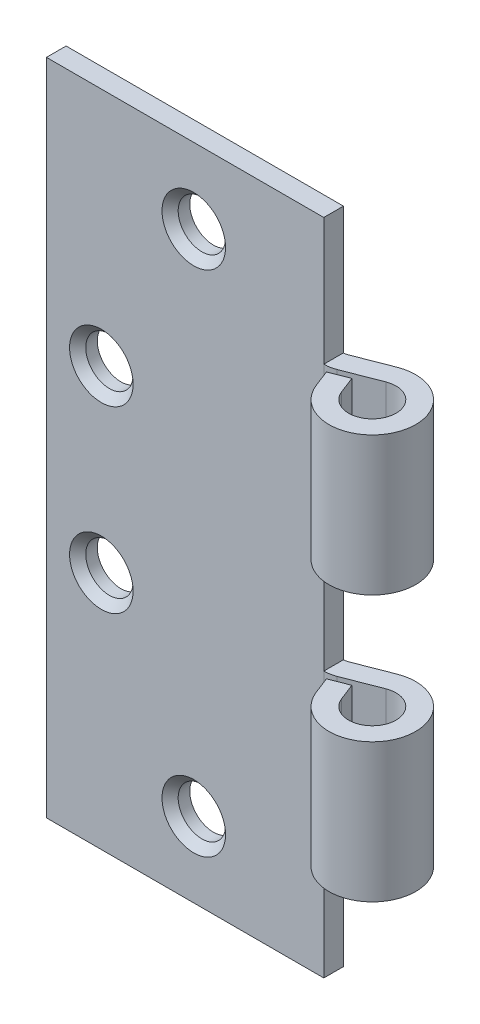
ISO-10303-21;
HEADER;
FILE_DESCRIPTION(('STEP AP214'),'2;1');
FILE_NAME('part.step','',(''),(''),'','','');
FILE_SCHEMA(('AUTOMOTIVE_DESIGN { 1 0 10303 214 1 1 1 1 }'));
ENDSEC;
DATA;
#1=APPLICATION_CONTEXT('core data for automotive mechanical design processes');
#2=APPLICATION_PROTOCOL_DEFINITION('international standard','automotive_design',2000,#1);
#3=PRODUCT_CONTEXT('',#1,'mechanical');
#4=PRODUCT('Part','Part','',(#3));
#5=PRODUCT_RELATED_PRODUCT_CATEGORY('part','',(#4));
#6=PRODUCT_DEFINITION_FORMATION('','',#4);
#7=PRODUCT_DEFINITION_CONTEXT('part definition',#1,'design');
#8=PRODUCT_DEFINITION('design','',#6,#7);
#9=PRODUCT_DEFINITION_SHAPE('','',#8);
#10=(LENGTH_UNIT() NAMED_UNIT(*) SI_UNIT(.MILLI.,.METRE.));
#11=(NAMED_UNIT(*) PLANE_ANGLE_UNIT() SI_UNIT($,.RADIAN.));
#12=(NAMED_UNIT(*) SI_UNIT($,.STERADIAN.) SOLID_ANGLE_UNIT());
#13=UNCERTAINTY_MEASURE_WITH_UNIT(LENGTH_MEASURE(1.E-05),#10,'distance_accuracy_value','');
#14=(GEOMETRIC_REPRESENTATION_CONTEXT(3) GLOBAL_UNCERTAINTY_ASSIGNED_CONTEXT((#13)) GLOBAL_UNIT_ASSIGNED_CONTEXT((#10,
#11,#12)) REPRESENTATION_CONTEXT('',''));
#15=CARTESIAN_POINT('',(0.,0.,0.));
#16=DIRECTION('',(0.,0.,1.));
#17=DIRECTION('',(1.,0.,0.));
#18=AXIS2_PLACEMENT_3D('',#15,#16,#17);
#19=CARTESIAN_POINT('',(41.,-35.,-4.7));
#20=DIRECTION('',(0.,1.,0.));
#21=DIRECTION('',(-1.,0.,0.));
#22=AXIS2_PLACEMENT_3D('',#19,#20,#21);
#23=PLANE('',#22);
#24=CARTESIAN_POINT('',(33.5,-35.,2.8));
#25=DIRECTION('',(0.,-1.,0.));
#26=DIRECTION('',(0.,0.,-1.));
#27=AXIS2_PLACEMENT_3D('',#24,#25,#26);
#28=CIRCLE('',#27,5.49999999999998);
#29=CARTESIAN_POINT('',(28.5976718591575,-35.,0.306572880651311));
#30=VERTEX_POINT('',#29);
#31=CARTESIAN_POINT('',(28.1424441919618,-35.,1.55637796587718));
#32=VERTEX_POINT('',#31);
#33=EDGE_CURVE('E203',#30,#32,#28,.T.);
#34=ORIENTED_EDGE('',*,*,#33,.F.);
#35=DIRECTION('',(0.932075471698113,0.,-0.362264150943397));
#36=VECTOR('',#35,1.);
#37=CARTESIAN_POINT('',(32.0147169811321,-35.,-1.02150943396228));
#38=LINE('',#37,#36);
#39=CARTESIAN_POINT('',(25.9562264150943,-35.,1.33320754716981));
#40=VERTEX_POINT('',#39);
#41=EDGE_CURVE('E226',#40,#30,#38,.T.);
#42=ORIENTED_EDGE('',*,*,#41,.F.);
#43=CARTESIAN_POINT('',(24.,-35.,-3.7));
#44=DIRECTION('',(0.,1.,0.));
#45=DIRECTION('',(-1.,0.,0.));
#46=AXIS2_PLACEMENT_3D('',#43,#44,#45);
#47=CIRCLE('',#46,5.39999999999999);
#48=CARTESIAN_POINT('',(24.,-35.,1.69999999999999));
#49=VERTEX_POINT('',#48);
#50=EDGE_CURVE('E387',#49,#40,#47,.T.);
#51=ORIENTED_EDGE('',*,*,#50,.F.);
#52=DIRECTION('',(0.,0.,1.));
#53=VECTOR('',#52,1.);
#54=CARTESIAN_POINT('',(24.,-35.,-4.7));
#55=LINE('',#54,#53);
#56=CARTESIAN_POINT('',(24.,-35.,-1.7));
#57=VERTEX_POINT('',#56);
#58=EDGE_CURVE('E221',#57,#49,#55,.T.);
#59=ORIENTED_EDGE('',*,*,#58,.F.);
#60=CARTESIAN_POINT('',(24.,-35.,-3.7));
#61=DIRECTION('',(0.,1.,0.));
#62=DIRECTION('',(-1.,0.,0.));
#63=AXIS2_PLACEMENT_3D('',#60,#61,#62);
#64=CIRCLE('',#63,2.);
#65=CARTESIAN_POINT('',(24.7245283018868,-35.,-1.83584905660377));
#66=VERTEX_POINT('',#65);
#67=EDGE_CURVE('E238',#66,#57,#64,.F.);
#68=ORIENTED_EDGE('',*,*,#67,.F.);
#69=DIRECTION('',(-0.932075471698113,0.,0.362264150943396));
#70=VECTOR('',#69,1.);
#71=CARTESIAN_POINT('',(30.7830188679246,-35.,-4.19056603773586));
#72=LINE('',#71,#70);
#73=CARTESIAN_POINT('',(30.7830188679245,-35.,-4.19056603773585));
#74=VERTEX_POINT('',#73);
#75=EDGE_CURVE('E235',#74,#66,#72,.T.);
#76=ORIENTED_EDGE('',*,*,#75,.F.);
#77=CARTESIAN_POINT('',(33.5,-35.,2.8));
#78=DIRECTION('',(0.,1.,0.));
#79=DIRECTION('',(-1.,0.,0.));
#80=AXIS2_PLACEMENT_3D('',#77,#78,#79);
#81=CIRCLE('',#80,7.5);
#82=CARTESIAN_POINT('',(26.5094339622641,-35.,5.51698113207547));
#83=VERTEX_POINT('',#82);
#84=EDGE_CURVE('E228',#83,#74,#81,.T.);
#85=ORIENTED_EDGE('',*,*,#84,.F.);
#86=DIRECTION('',(0.362264150943398,0.,0.932075471698113));
#87=VECTOR('',#86,1.);
#88=CARTESIAN_POINT('',(26.5094339622642,-35.,5.51698113207549));
#89=LINE('',#88,#87);
#90=CARTESIAN_POINT('',(25.3864150943396,-35.,2.62754716981132));
#91=VERTEX_POINT('',#90);
#92=EDGE_CURVE('E224',#91,#83,#89,.T.);
#93=ORIENTED_EDGE('',*,*,#92,.F.);
#94=DIRECTION('',(-0.932075471698113,0.,0.362264150943396));
#95=VECTOR('',#94,1.);
#96=CARTESIAN_POINT('',(25.3864150943397,-35.,2.62754716981131));
#97=LINE('',#96,#95);
#98=EDGE_CURVE('E217',#32,#91,#97,.T.);
#99=ORIENTED_EDGE('',*,*,#98,.F.);
#100=EDGE_LOOP('',(#34,#42,#51,#59,#68,#76,#85,#93,#99));
#101=FACE_BOUND('',#100,.T.);
#102=ADVANCED_FACE('F34',(#101),#23,.F.);
#103=CARTESIAN_POINT('',(24.,79.6715680975093,-3.7));
#104=DIRECTION('',(0.,-1.,0.));
#105=DIRECTION('',(0.,0.,-1.));
#106=AXIS2_PLACEMENT_3D('',#103,#104,#105);
#107=CYLINDRICAL_SURFACE('',#106,2.);
#108=DIRECTION('',(0.,1.,0.));
#109=VECTOR('',#108,1.);
#110=CARTESIAN_POINT('',(24.,57.,-1.7));
#111=LINE('',#110,#109);
#112=CARTESIAN_POINT('',(24.,11.,-1.7));
#113=VERTEX_POINT('',#112);
#114=CARTESIAN_POINT('',(24.,35.,-1.7));
#115=VERTEX_POINT('',#114);
#116=EDGE_CURVE('E358',#113,#115,#111,.T.);
#117=ORIENTED_EDGE('',*,*,#116,.T.);
#118=CARTESIAN_POINT('',(24.,35.,-3.7));
#119=DIRECTION('',(0.,-1.,0.));
#120=DIRECTION('',(1.,0.,0.));
#121=AXIS2_PLACEMENT_3D('',#118,#119,#120);
#122=CIRCLE('',#121,2.);
#123=CARTESIAN_POINT('',(24.7245283018868,35.,-1.83584905660377));
#124=VERTEX_POINT('',#123);
#125=EDGE_CURVE('E313',#115,#124,#122,.F.);
#126=ORIENTED_EDGE('',*,*,#125,.T.);
#127=DIRECTION('',(0.,-1.,0.));
#128=VECTOR('',#127,1.);
#129=CARTESIAN_POINT('',(24.7245283018868,79.6715680975093,-1.83584905660378));
#130=LINE('',#129,#128);
#131=CARTESIAN_POINT('',(24.7245283018868,11.,-1.83584905660377));
#132=VERTEX_POINT('',#131);
#133=EDGE_CURVE('E319',#124,#132,#130,.T.);
#134=ORIENTED_EDGE('',*,*,#133,.T.);
#135=CARTESIAN_POINT('',(24.,11.,-3.7));
#136=DIRECTION('',(0.,1.,0.));
#137=DIRECTION('',(0.,0.,1.));
#138=AXIS2_PLACEMENT_3D('',#135,#136,#137);
#139=CIRCLE('',#138,2.);
#140=EDGE_CURVE('E284',#132,#113,#139,.F.);
#141=ORIENTED_EDGE('',*,*,#140,.T.);
#142=EDGE_LOOP('',(#117,#126,#134,#141));
#143=FACE_BOUND('',#142,.T.);
#144=ADVANCED_FACE('F479',(#143),#107,.F.);
#145=CARTESIAN_POINT('',(30.7830188679245,79.6715680975093,-4.19056603773585));
#146=DIRECTION('',(0.362264150943396,0.,0.932075471698113));
#147=DIRECTION('',(0.932075471698113,0.,-0.362264150943396));
#148=AXIS2_PLACEMENT_3D('',#145,#146,#147);
#149=PLANE('',#148);
#150=ORIENTED_EDGE('',*,*,#133,.F.);
#151=DIRECTION('',(0.932075471698113,0.,-0.362264150943396));
#152=VECTOR('',#151,1.);
#153=CARTESIAN_POINT('',(30.7830188679245,35.,-4.19056603773585));
#154=LINE('',#153,#152);
#155=CARTESIAN_POINT('',(30.7830188679245,35.,-4.19056603773585));
#156=VERTEX_POINT('',#155);
#157=EDGE_CURVE('E310',#124,#156,#154,.T.);
#158=ORIENTED_EDGE('',*,*,#157,.T.);
#159=DIRECTION('',(0.,-1.,0.));
#160=VECTOR('',#159,1.);
#161=CARTESIAN_POINT('',(30.7830188679245,79.6715680975093,-4.19056603773585));
#162=LINE('',#161,#160);
#163=CARTESIAN_POINT('',(30.7830188679245,11.,-4.19056603773585));
#164=VERTEX_POINT('',#163);
#165=EDGE_CURVE('E323',#156,#164,#162,.T.);
#166=ORIENTED_EDGE('',*,*,#165,.T.);
#167=DIRECTION('',(-0.932075471698113,0.,0.362264150943396));
#168=VECTOR('',#167,1.);
#169=CARTESIAN_POINT('',(30.7830188679245,11.,-4.19056603773585));
#170=LINE('',#169,#168);
#171=EDGE_CURVE('E281',#164,#132,#170,.T.);
#172=ORIENTED_EDGE('',*,*,#171,.T.);
#173=EDGE_LOOP('',(#150,#158,#166,#172));
#174=FACE_BOUND('',#173,.T.);
#175=ADVANCED_FACE('F484',(#174),#149,.F.);
#176=CARTESIAN_POINT('',(33.5,79.6715680975093,2.8));
#177=DIRECTION('',(0.,-1.,0.));
#178=DIRECTION('',(0.,0.,-1.));
#179=AXIS2_PLACEMENT_3D('',#176,#177,#178);
#180=CYLINDRICAL_SURFACE('',#179,7.5);
#181=ORIENTED_EDGE('',*,*,#165,.F.);
#182=CARTESIAN_POINT('',(33.5,35.,2.8));
#183=DIRECTION('',(0.,-1.,0.));
#184=DIRECTION('',(1.,0.,0.));
#185=AXIS2_PLACEMENT_3D('',#182,#183,#184);
#186=CIRCLE('',#185,7.5);
#187=CARTESIAN_POINT('',(26.5094339622641,35.,5.51698113207547));
#188=VERTEX_POINT('',#187);
#189=EDGE_CURVE('E308',#156,#188,#186,.T.);
#190=ORIENTED_EDGE('',*,*,#189,.T.);
#191=DIRECTION('',(0.,-1.,0.));
#192=VECTOR('',#191,1.);
#193=CARTESIAN_POINT('',(26.5094339622641,79.6715680975093,5.51698113207547));
#194=LINE('',#193,#192);
#195=CARTESIAN_POINT('',(26.5094339622641,11.,5.51698113207547));
#196=VERTEX_POINT('',#195);
#197=EDGE_CURVE('E327',#188,#196,#194,.T.);
#198=ORIENTED_EDGE('',*,*,#197,.T.);
#199=CARTESIAN_POINT('',(33.5,11.,2.8));
#200=DIRECTION('',(0.,1.,0.));
#201=DIRECTION('',(0.,0.,1.));
#202=AXIS2_PLACEMENT_3D('',#199,#200,#201);
#203=CIRCLE('',#202,7.5);
#204=EDGE_CURVE('E279',#196,#164,#203,.T.);
#205=ORIENTED_EDGE('',*,*,#204,.T.);
#206=EDGE_LOOP('',(#181,#190,#198,#205));
#207=FACE_BOUND('',#206,.T.);
#208=ADVANCED_FACE('F503',(#207),#180,.T.);
#209=CARTESIAN_POINT('',(26.5094339622641,79.6715680975093,5.51698113207547));
#210=DIRECTION('',(0.932075471698113,0.,-0.362264150943398));
#211=DIRECTION('',(-0.362264150943398,0.,-0.932075471698113));
#212=AXIS2_PLACEMENT_3D('',#209,#210,#211);
#213=PLANE('',#212);
#214=ORIENTED_EDGE('',*,*,#197,.F.);
#215=DIRECTION('',(-0.362264150943398,0.,-0.932075471698113));
#216=VECTOR('',#215,1.);
#217=CARTESIAN_POINT('',(26.5094339622641,35.,5.51698113207548));
#218=LINE('',#217,#216);
#219=CARTESIAN_POINT('',(25.3864150943396,35.,2.62754716981132));
#220=VERTEX_POINT('',#219);
#221=EDGE_CURVE('E305',#188,#220,#218,.T.);
#222=ORIENTED_EDGE('',*,*,#221,.T.);
#223=DIRECTION('',(0.,-1.,0.));
#224=VECTOR('',#223,1.);
#225=CARTESIAN_POINT('',(25.3864150943396,79.6715680975093,2.62754716981132));
#226=LINE('',#225,#224);
#227=CARTESIAN_POINT('',(25.3864150943396,11.,2.62754716981132));
#228=VERTEX_POINT('',#227);
#229=EDGE_CURVE('E330',#220,#228,#226,.T.);
#230=ORIENTED_EDGE('',*,*,#229,.T.);
#231=DIRECTION('',(0.362264150943398,0.,0.932075471698113));
#232=VECTOR('',#231,1.);
#233=CARTESIAN_POINT('',(26.5094339622641,11.,5.51698113207547));
#234=LINE('',#233,#232);
#235=EDGE_CURVE('E276',#228,#196,#234,.T.);
#236=ORIENTED_EDGE('',*,*,#235,.T.);
#237=EDGE_LOOP('',(#214,#222,#230,#236));
#238=FACE_BOUND('',#237,.T.);
#239=ADVANCED_FACE('F506',(#238),#213,.F.);
#240=CARTESIAN_POINT('',(25.3864150943396,79.6715680975093,2.62754716981132));
#241=DIRECTION('',(0.362264150943396,0.,0.932075471698113));
#242=DIRECTION('',(0.932075471698113,0.,-0.362264150943396));
#243=AXIS2_PLACEMENT_3D('',#240,#241,#242);
#244=PLANE('',#243);
#245=ORIENTED_EDGE('',*,*,#229,.F.);
#246=DIRECTION('',(0.932075471698113,0.,-0.362264150943396));
#247=VECTOR('',#246,1.);
#248=CARTESIAN_POINT('',(25.3864150943396,35.,2.62754716981132));
#249=LINE('',#248,#247);
#250=CARTESIAN_POINT('',(28.5554716981132,35.,1.39584905660377));
#251=VERTEX_POINT('',#250);
#252=EDGE_CURVE('E302',#220,#251,#249,.T.);
#253=ORIENTED_EDGE('',*,*,#252,.T.);
#254=DIRECTION('',(0.,-1.,0.));
#255=VECTOR('',#254,1.);
#256=CARTESIAN_POINT('',(28.5554716981132,79.6715680975093,1.39584905660377));
#257=LINE('',#256,#255);
#258=CARTESIAN_POINT('',(28.5554716981132,11.,1.39584905660377));
#259=VERTEX_POINT('',#258);
#260=EDGE_CURVE('E333',#251,#259,#257,.T.);
#261=ORIENTED_EDGE('',*,*,#260,.T.);
#262=DIRECTION('',(-0.932075471698113,0.,0.362264150943396));
#263=VECTOR('',#262,1.);
#264=CARTESIAN_POINT('',(25.3864150943396,11.,2.62754716981132));
#265=LINE('',#264,#263);
#266=EDGE_CURVE('E273',#259,#228,#265,.T.);
#267=ORIENTED_EDGE('',*,*,#266,.T.);
#268=EDGE_LOOP('',(#245,#253,#261,#267));
#269=FACE_BOUND('',#268,.T.);
#270=ADVANCED_FACE('F510',(#269),#244,.F.);
#271=CARTESIAN_POINT('',(29.6784905660377,79.6715680975093,4.28528301886792));
#272=DIRECTION('',(-0.932075471698113,0.,0.362264150943396));
#273=DIRECTION('',(0.362264150943396,0.,0.932075471698113));
#274=AXIS2_PLACEMENT_3D('',#271,#272,#273);
#275=PLANE('',#274);
#276=ORIENTED_EDGE('',*,*,#260,.F.);
#277=DIRECTION('',(0.362264150943396,0.,0.932075471698113));
#278=VECTOR('',#277,1.);
#279=CARTESIAN_POINT('',(29.6784905660377,35.,4.28528301886793));
#280=LINE('',#279,#278);
#281=CARTESIAN_POINT('',(29.6784905660377,35.,4.28528301886792));
#282=VERTEX_POINT('',#281);
#283=EDGE_CURVE('E299',#251,#282,#280,.T.);
#284=ORIENTED_EDGE('',*,*,#283,.T.);
#285=DIRECTION('',(0.,-1.,0.));
#286=VECTOR('',#285,1.);
#287=CARTESIAN_POINT('',(29.6784905660377,79.6715680975093,4.28528301886792));
#288=LINE('',#287,#286);
#289=CARTESIAN_POINT('',(29.6784905660377,11.,4.28528301886792));
#290=VERTEX_POINT('',#289);
#291=EDGE_CURVE('E337',#282,#290,#288,.T.);
#292=ORIENTED_EDGE('',*,*,#291,.T.);
#293=DIRECTION('',(-0.362264150943396,0.,-0.932075471698113));
#294=VECTOR('',#293,1.);
#295=CARTESIAN_POINT('',(29.6784905660377,11.,4.28528301886792));
#296=LINE('',#295,#294);
#297=EDGE_CURVE('E270',#290,#259,#296,.T.);
#298=ORIENTED_EDGE('',*,*,#297,.T.);
#299=EDGE_LOOP('',(#276,#284,#292,#298));
#300=FACE_BOUND('',#299,.T.);
#301=ADVANCED_FACE('F464',(#300),#275,.F.);
#302=CARTESIAN_POINT('',(33.5,79.6715680975093,2.8));
#303=DIRECTION('',(0.,-1.,0.));
#304=DIRECTION('',(0.,0.,-1.));
#305=AXIS2_PLACEMENT_3D('',#302,#303,#304);
#306=CYLINDRICAL_SURFACE('',#305,4.1);
#307=ORIENTED_EDGE('',*,*,#291,.F.);
#308=CARTESIAN_POINT('',(33.5,35.,2.8));
#309=DIRECTION('',(0.,-1.,0.));
#310=DIRECTION('',(1.,0.,0.));
#311=AXIS2_PLACEMENT_3D('',#308,#309,#310);
#312=CIRCLE('',#311,4.1);
#313=CARTESIAN_POINT('',(32.0147169811321,35.,-1.02150943396227));
#314=VERTEX_POINT('',#313);
#315=EDGE_CURVE('E296',#282,#314,#312,.F.);
#316=ORIENTED_EDGE('',*,*,#315,.T.);
#317=DIRECTION('',(0.,-1.,0.));
#318=VECTOR('',#317,1.);
#319=CARTESIAN_POINT('',(32.0147169811321,79.6715680975093,-1.02150943396226));
#320=LINE('',#319,#318);
#321=CARTESIAN_POINT('',(32.0147169811321,11.,-1.02150943396227));
#322=VERTEX_POINT('',#321);
#323=EDGE_CURVE('E341',#314,#322,#320,.T.);
#324=ORIENTED_EDGE('',*,*,#323,.T.);
#325=CARTESIAN_POINT('',(33.5,11.,2.8));
#326=DIRECTION('',(0.,1.,0.));
#327=DIRECTION('',(0.,0.,1.));
#328=AXIS2_PLACEMENT_3D('',#325,#326,#327);
#329=CIRCLE('',#328,4.1);
#330=EDGE_CURVE('E267',#322,#290,#329,.F.);
#331=ORIENTED_EDGE('',*,*,#330,.T.);
#332=EDGE_LOOP('',(#307,#316,#324,#331));
#333=FACE_BOUND('',#332,.T.);
#334=ADVANCED_FACE('F469',(#333),#306,.F.);
#335=CARTESIAN_POINT('',(32.0147169811321,79.6715680975093,-1.02150943396227));
#336=DIRECTION('',(-0.362264150943397,0.,-0.932075471698113));
#337=DIRECTION('',(-0.932075471698113,0.,0.362264150943397));
#338=AXIS2_PLACEMENT_3D('',#335,#336,#337);
#339=PLANE('',#338);
#340=ORIENTED_EDGE('',*,*,#323,.F.);
#341=DIRECTION('',(-0.932075471698113,0.,0.362264150943397));
#342=VECTOR('',#341,1.);
#343=CARTESIAN_POINT('',(32.0147169811321,35.,-1.02150943396227));
#344=LINE('',#343,#342);
#345=CARTESIAN_POINT('',(25.9562264150943,35.,1.3332075471698));
#346=VERTEX_POINT('',#345);
#347=EDGE_CURVE('E293',#314,#346,#344,.T.);
#348=ORIENTED_EDGE('',*,*,#347,.T.);
#349=DIRECTION('',(0.,-1.,0.));
#350=VECTOR('',#349,1.);
#351=CARTESIAN_POINT('',(25.9562264150943,79.6715680975093,1.33320754716981));
#352=LINE('',#351,#350);
#353=CARTESIAN_POINT('',(25.9562264150943,11.,1.3332075471698));
#354=VERTEX_POINT('',#353);
#355=EDGE_CURVE('E345',#346,#354,#352,.T.);
#356=ORIENTED_EDGE('',*,*,#355,.T.);
#357=DIRECTION('',(0.932075471698113,0.,-0.362264150943397));
#358=VECTOR('',#357,1.);
#359=CARTESIAN_POINT('',(32.0147169811321,11.,-1.02150943396227));
#360=LINE('',#359,#358);
#361=EDGE_CURVE('E264',#354,#322,#360,.T.);
#362=ORIENTED_EDGE('',*,*,#361,.T.);
#363=EDGE_LOOP('',(#340,#348,#356,#362));
#364=FACE_BOUND('',#363,.T.);
#365=ADVANCED_FACE('F475',(#364),#339,.F.);
#366=CARTESIAN_POINT('',(24.,79.6715680975093,-3.7));
#367=DIRECTION('',(0.,-1.,0.));
#368=DIRECTION('',(0.,0.,-1.));
#369=AXIS2_PLACEMENT_3D('',#366,#367,#368);
#370=CYLINDRICAL_SURFACE('',#369,5.39999999999999);
#371=ORIENTED_EDGE('',*,*,#355,.F.);
#372=CARTESIAN_POINT('',(24.,35.,-3.7));
#373=DIRECTION('',(0.,-1.,0.));
#374=DIRECTION('',(1.,0.,0.));
#375=AXIS2_PLACEMENT_3D('',#372,#373,#374);
#376=CIRCLE('',#375,5.39999999999999);
#377=CARTESIAN_POINT('',(24.,35.,1.69999999999999));
#378=VERTEX_POINT('',#377);
#379=EDGE_CURVE('E396',#346,#378,#376,.T.);
#380=ORIENTED_EDGE('',*,*,#379,.T.);
#381=DIRECTION('',(0.,1.,0.));
#382=VECTOR('',#381,1.);
#383=CARTESIAN_POINT('',(24.,57.,1.7));
#384=LINE('',#383,#382);
#385=CARTESIAN_POINT('',(24.,11.,1.69999999999999));
#386=VERTEX_POINT('',#385);
#387=EDGE_CURVE('E548',#386,#378,#384,.T.);
#388=ORIENTED_EDGE('',*,*,#387,.F.);
#389=CARTESIAN_POINT('',(24.,11.,-3.7));
#390=DIRECTION('',(0.,1.,0.));
#391=DIRECTION('',(0.,0.,1.));
#392=AXIS2_PLACEMENT_3D('',#389,#390,#391);
#393=CIRCLE('',#392,5.39999999999999);
#394=EDGE_CURVE('E393',#386,#354,#393,.T.);
#395=ORIENTED_EDGE('',*,*,#394,.T.);
#396=EDGE_LOOP('',(#371,#380,#388,#395));
#397=FACE_BOUND('',#396,.T.);
#398=ADVANCED_FACE('F546',(#397),#370,.T.);
#399=CARTESIAN_POINT('',(-24.,57.,1.7));
#400=DIRECTION('',(0.,-1.,0.));
#401=DIRECTION('',(0.,0.,-1.));
#402=AXIS2_PLACEMENT_3D('',#399,#400,#401);
#403=PLANE('',#402);
#404=DIRECTION('',(-1.,0.,0.));
#405=VECTOR('',#404,1.);
#406=CARTESIAN_POINT('',(-24.,57.,1.7));
#407=LINE('',#406,#405);
#408=CARTESIAN_POINT('',(24.,57.,1.7));
#409=VERTEX_POINT('',#408);
#410=CARTESIAN_POINT('',(-24.,57.,1.7));
#411=VERTEX_POINT('',#410);
#412=EDGE_CURVE('E362',#409,#411,#407,.T.);
#413=ORIENTED_EDGE('',*,*,#412,.F.);
#414=DIRECTION('',(0.,0.,1.));
#415=VECTOR('',#414,1.);
#416=CARTESIAN_POINT('',(24.,57.,-4.7));
#417=LINE('',#416,#415);
#418=CARTESIAN_POINT('',(24.,57.,-1.7));
#419=VERTEX_POINT('',#418);
#420=EDGE_CURVE('E585',#419,#409,#417,.T.);
#421=ORIENTED_EDGE('',*,*,#420,.F.);
#422=DIRECTION('',(-1.,0.,0.));
#423=VECTOR('',#422,1.);
#424=CARTESIAN_POINT('',(-24.,57.,-1.7));
#425=LINE('',#424,#423);
#426=CARTESIAN_POINT('',(-24.,57.,-1.7));
#427=VERTEX_POINT('',#426);
#428=EDGE_CURVE('E374',#419,#427,#425,.T.);
#429=ORIENTED_EDGE('',*,*,#428,.T.);
#430=DIRECTION('',(0.,0.,-1.));
#431=VECTOR('',#430,1.);
#432=CARTESIAN_POINT('',(-24.,57.,1.7));
#433=LINE('',#432,#431);
#434=EDGE_CURVE('E384',#411,#427,#433,.T.);
#435=ORIENTED_EDGE('',*,*,#434,.F.);
#436=EDGE_LOOP('',(#413,#421,#429,#435));
#437=FACE_BOUND('',#436,.T.);
#438=ADVANCED_FACE('F588',(#437),#403,.F.);
#439=CARTESIAN_POINT('',(-24.,57.,1.7));
#440=DIRECTION('',(1.,0.,0.));
#441=DIRECTION('',(0.,1.,0.));
#442=AXIS2_PLACEMENT_3D('',#439,#440,#441);
#443=PLANE('',#442);
#444=DIRECTION('',(0.,-1.,0.));
#445=VECTOR('',#444,1.);
#446=CARTESIAN_POINT('',(-24.,57.,-1.7));
#447=LINE('',#446,#445);
#448=CARTESIAN_POINT('',(-24.,-57.,-1.7));
#449=VERTEX_POINT('',#448);
#450=EDGE_CURVE('E377',#427,#449,#447,.T.);
#451=ORIENTED_EDGE('',*,*,#450,.T.);
#452=DIRECTION('',(0.,0.,-1.));
#453=VECTOR('',#452,1.);
#454=CARTESIAN_POINT('',(-24.,-57.,1.7));
#455=LINE('',#454,#453);
#456=CARTESIAN_POINT('',(-24.,-57.,1.7));
#457=VERTEX_POINT('',#456);
#458=EDGE_CURVE('E371',#457,#449,#455,.T.);
#459=ORIENTED_EDGE('',*,*,#458,.F.);
#460=DIRECTION('',(0.,-1.,0.));
#461=VECTOR('',#460,1.);
#462=CARTESIAN_POINT('',(-24.,57.,1.7));
#463=LINE('',#462,#461);
#464=EDGE_CURVE('E366',#411,#457,#463,.T.);
#465=ORIENTED_EDGE('',*,*,#464,.F.);
#466=ORIENTED_EDGE('',*,*,#434,.T.);
#467=EDGE_LOOP('',(#451,#459,#465,#466));
#468=FACE_BOUND('',#467,.T.);
#469=ADVANCED_FACE('F607',(#468),#443,.F.);
#470=CARTESIAN_POINT('',(-24.,-57.,1.7));
#471=DIRECTION('',(0.,1.,0.));
#472=DIRECTION('',(0.,0.,1.));
#473=AXIS2_PLACEMENT_3D('',#470,#471,#472);
#474=PLANE('',#473);
#475=DIRECTION('',(1.,0.,0.));
#476=VECTOR('',#475,1.);
#477=CARTESIAN_POINT('',(-24.,-57.,-1.7));
#478=LINE('',#477,#476);
#479=CARTESIAN_POINT('',(24.,-57.,-1.7));
#480=VERTEX_POINT('',#479);
#481=EDGE_CURVE('E379',#449,#480,#478,.T.);
#482=ORIENTED_EDGE('',*,*,#481,.T.);
#483=DIRECTION('',(0.,0.,1.));
#484=VECTOR('',#483,1.);
#485=CARTESIAN_POINT('',(24.,-57.,-4.7));
#486=LINE('',#485,#484);
#487=CARTESIAN_POINT('',(24.,-57.,1.69999999999999));
#488=VERTEX_POINT('',#487);
#489=EDGE_CURVE('E595',#480,#488,#486,.T.);
#490=ORIENTED_EDGE('',*,*,#489,.T.);
#491=DIRECTION('',(1.,0.,0.));
#492=VECTOR('',#491,1.);
#493=CARTESIAN_POINT('',(-24.,-57.,1.7));
#494=LINE('',#493,#492);
#495=EDGE_CURVE('E368',#457,#488,#494,.T.);
#496=ORIENTED_EDGE('',*,*,#495,.F.);
#497=ORIENTED_EDGE('',*,*,#458,.T.);
#498=EDGE_LOOP('',(#482,#490,#496,#497));
#499=FACE_BOUND('',#498,.T.);
#500=ADVANCED_FACE('F602',(#499),#474,.F.);
#501=CARTESIAN_POINT('',(0.,0.,1.7));
#502=DIRECTION('',(0.,0.,1.));
#503=DIRECTION('',(1.,0.,0.));
#504=AXIS2_PLACEMENT_3D('',#501,#502,#503);
#505=PLANE('',#504);
#506=CARTESIAN_POINT('',(1.49999999999998,-44.,1.7));
#507=DIRECTION('',(0.,0.,1.));
#508=DIRECTION('',(1.,0.,0.));
#509=AXIS2_PLACEMENT_3D('',#506,#507,#508);
#510=CIRCLE('',#509,5.49999999999999);
#511=CARTESIAN_POINT('',(6.99999999999998,-44.,1.7));
#512=VERTEX_POINT('',#511);
#513=EDGE_CURVE('E411',#512,#512,#510,.F.);
#514=ORIENTED_EDGE('',*,*,#513,.T.);
#515=EDGE_LOOP('',(#514));
#516=FACE_BOUND('',#515,.T.);
#517=CARTESIAN_POINT('',(-14.5,-15.5,1.7));
#518=DIRECTION('',(0.,0.,1.));
#519=DIRECTION('',(1.,0.,0.));
#520=AXIS2_PLACEMENT_3D('',#517,#518,#519);
#521=CIRCLE('',#520,5.49999999999999);
#522=CARTESIAN_POINT('',(-9.00000000000002,-15.5,1.7));
#523=VERTEX_POINT('',#522);
#524=EDGE_CURVE('E408',#523,#523,#521,.F.);
#525=ORIENTED_EDGE('',*,*,#524,.T.);
#526=EDGE_LOOP('',(#525));
#527=FACE_BOUND('',#526,.T.);
#528=CARTESIAN_POINT('',(-14.5,15.5,1.7));
#529=DIRECTION('',(0.,0.,1.));
#530=DIRECTION('',(1.,0.,0.));
#531=AXIS2_PLACEMENT_3D('',#528,#529,#530);
#532=CIRCLE('',#531,5.49999999999999);
#533=CARTESIAN_POINT('',(-9.00000000000002,15.5,1.7));
#534=VERTEX_POINT('',#533);
#535=EDGE_CURVE('E405',#534,#534,#532,.F.);
#536=ORIENTED_EDGE('',*,*,#535,.T.);
#537=EDGE_LOOP('',(#536));
#538=FACE_BOUND('',#537,.T.);
#539=CARTESIAN_POINT('',(1.49999999999998,44.,1.7));
#540=DIRECTION('',(0.,0.,1.));
#541=DIRECTION('',(1.,0.,0.));
#542=AXIS2_PLACEMENT_3D('',#539,#540,#541);
#543=CIRCLE('',#542,5.49999999999999);
#544=CARTESIAN_POINT('',(6.99999999999998,44.,1.7));
#545=VERTEX_POINT('',#544);
#546=EDGE_CURVE('E402',#545,#545,#543,.F.);
#547=ORIENTED_EDGE('',*,*,#546,.T.);
#548=EDGE_LOOP('',(#547));
#549=FACE_BOUND('',#548,.T.);
#550=EDGE_CURVE('E359',#488,#49,#384,.T.);
#551=ORIENTED_EDGE('',*,*,#550,.T.);
#552=CARTESIAN_POINT('',(24.,-11.,1.7));
#553=VERTEX_POINT('',#552);
#554=EDGE_CURVE('E363',#49,#553,#384,.T.);
#555=ORIENTED_EDGE('',*,*,#554,.T.);
#556=EDGE_CURVE('E552',#553,#386,#384,.T.);
#557=ORIENTED_EDGE('',*,*,#556,.T.);
#558=ORIENTED_EDGE('',*,*,#387,.T.);
#559=EDGE_CURVE('E364',#378,#409,#384,.T.);
#560=ORIENTED_EDGE('',*,*,#559,.T.);
#561=ORIENTED_EDGE('',*,*,#412,.T.);
#562=ORIENTED_EDGE('',*,*,#464,.T.);
#563=ORIENTED_EDGE('',*,*,#495,.T.);
#564=EDGE_LOOP('',(#551,#555,#557,#558,#560,#561,#562,#563));
#565=FACE_BOUND('',#564,.T.);
#566=ADVANCED_FACE('F554',(#516,#527,#538,#549,#565),#505,.T.);
#567=CARTESIAN_POINT('',(0.,0.,-1.7));
#568=DIRECTION('',(0.,0.,1.));
#569=DIRECTION('',(1.,0.,0.));
#570=AXIS2_PLACEMENT_3D('',#567,#568,#569);
#571=PLANE('',#570);
#572=CARTESIAN_POINT('',(1.49999999999998,-44.,-1.7));
#573=DIRECTION('',(0.,0.,1.));
#574=DIRECTION('',(1.,0.,0.));
#575=AXIS2_PLACEMENT_3D('',#572,#573,#574);
#576=CIRCLE('',#575,4.1);
#577=CARTESIAN_POINT('',(5.59999999999998,-44.,-1.7));
#578=VERTEX_POINT('',#577);
#579=EDGE_CURVE('E346',#578,#578,#576,.T.);
#580=ORIENTED_EDGE('',*,*,#579,.T.);
#581=EDGE_LOOP('',(#580));
#582=FACE_BOUND('',#581,.T.);
#583=CARTESIAN_POINT('',(-14.5,-15.5,-1.7));
#584=DIRECTION('',(0.,0.,1.));
#585=DIRECTION('',(1.,0.,0.));
#586=AXIS2_PLACEMENT_3D('',#583,#584,#585);
#587=CIRCLE('',#586,4.1);
#588=CARTESIAN_POINT('',(-10.4,-15.5,-1.7));
#589=VERTEX_POINT('',#588);
#590=EDGE_CURVE('E349',#589,#589,#587,.T.);
#591=ORIENTED_EDGE('',*,*,#590,.T.);
#592=EDGE_LOOP('',(#591));
#593=FACE_BOUND('',#592,.T.);
#594=CARTESIAN_POINT('',(1.49999999999998,44.,-1.7));
#595=DIRECTION('',(0.,0.,1.));
#596=DIRECTION('',(1.,0.,0.));
#597=AXIS2_PLACEMENT_3D('',#594,#595,#596);
#598=CIRCLE('',#597,4.1);
#599=CARTESIAN_POINT('',(5.59999999999998,44.,-1.7));
#600=VERTEX_POINT('',#599);
#601=EDGE_CURVE('E352',#600,#600,#598,.T.);
#602=ORIENTED_EDGE('',*,*,#601,.T.);
#603=EDGE_LOOP('',(#602));
#604=FACE_BOUND('',#603,.T.);
#605=CARTESIAN_POINT('',(-14.5,15.5,-1.7));
#606=DIRECTION('',(0.,0.,1.));
#607=DIRECTION('',(1.,0.,0.));
#608=AXIS2_PLACEMENT_3D('',#605,#606,#607);
#609=CIRCLE('',#608,4.1);
#610=CARTESIAN_POINT('',(-10.4,15.5,-1.7));
#611=VERTEX_POINT('',#610);
#612=EDGE_CURVE('E355',#611,#611,#609,.T.);
#613=ORIENTED_EDGE('',*,*,#612,.T.);
#614=EDGE_LOOP('',(#613));
#615=FACE_BOUND('',#614,.T.);
#616=EDGE_CURVE('E372',#480,#57,#111,.T.);
#617=ORIENTED_EDGE('',*,*,#616,.F.);
#618=ORIENTED_EDGE('',*,*,#481,.F.);
#619=ORIENTED_EDGE('',*,*,#450,.F.);
#620=ORIENTED_EDGE('',*,*,#428,.F.);
#621=DIRECTION('',(0.,-1.,0.));
#622=VECTOR('',#621,1.);
#623=CARTESIAN_POINT('',(24.,79.6715680975093,-1.7));
#624=LINE('',#623,#622);
#625=EDGE_CURVE('E290',#419,#115,#624,.T.);
#626=ORIENTED_EDGE('',*,*,#625,.T.);
#627=ORIENTED_EDGE('',*,*,#116,.F.);
#628=DIRECTION('',(0.,-1.,0.));
#629=VECTOR('',#628,1.);
#630=CARTESIAN_POINT('',(24.,79.6715680975093,-1.7));
#631=LINE('',#630,#629);
#632=CARTESIAN_POINT('',(24.,-11.,-1.7));
#633=VERTEX_POINT('',#632);
#634=EDGE_CURVE('E287',#113,#633,#631,.T.);
#635=ORIENTED_EDGE('',*,*,#634,.T.);
#636=EDGE_CURVE('E375',#57,#633,#111,.T.);
#637=ORIENTED_EDGE('',*,*,#636,.F.);
#638=EDGE_LOOP('',(#617,#618,#619,#620,#626,#627,#635,#637));
#639=FACE_BOUND('',#638,.T.);
#640=ADVANCED_FACE('F578',(#582,#593,#604,#615,#639),#571,.F.);
#641=CARTESIAN_POINT('',(-14.5,15.5,1.7));
#642=DIRECTION('',(0.,0.,1.));
#643=DIRECTION('',(1.,0.,0.));
#644=AXIS2_PLACEMENT_3D('',#641,#642,#643);
#645=CYLINDRICAL_SURFACE('',#644,4.09999999999999);
#646=CARTESIAN_POINT('',(-14.5,15.5,0.300000000000014));
#647=DIRECTION('',(0.,0.,1.));
#648=DIRECTION('',(1.,0.,0.));
#649=AXIS2_PLACEMENT_3D('',#646,#647,#648);
#650=CIRCLE('',#649,4.09999999999999);
#651=CARTESIAN_POINT('',(-10.4,15.5,0.300000000000014));
#652=VERTEX_POINT('',#651);
#653=EDGE_CURVE('E417',#652,#652,#650,.T.);
#654=ORIENTED_EDGE('',*,*,#653,.T.);
#655=EDGE_LOOP('',(#654));
#656=FACE_BOUND('',#655,.T.);
#657=ORIENTED_EDGE('',*,*,#612,.F.);
#658=EDGE_LOOP('',(#657));
#659=FACE_BOUND('',#658,.T.);
#660=ADVANCED_FACE('F687',(#656,#659),#645,.F.);
#661=CARTESIAN_POINT('',(1.49999999999998,44.,1.7));
#662=DIRECTION('',(0.,0.,1.));
#663=DIRECTION('',(1.,0.,0.));
#664=AXIS2_PLACEMENT_3D('',#661,#662,#663);
#665=CYLINDRICAL_SURFACE('',#664,4.09999999999999);
#666=CARTESIAN_POINT('',(1.49999999999998,44.,0.300000000000014));
#667=DIRECTION('',(0.,0.,1.));
#668=DIRECTION('',(1.,0.,0.));
#669=AXIS2_PLACEMENT_3D('',#666,#667,#668);
#670=CIRCLE('',#669,4.09999999999999);
#671=CARTESIAN_POINT('',(5.59999999999998,44.,0.300000000000014));
#672=VERTEX_POINT('',#671);
#673=EDGE_CURVE('E211',#672,#672,#670,.T.);
#674=ORIENTED_EDGE('',*,*,#673,.T.);
#675=EDGE_LOOP('',(#674));
#676=FACE_BOUND('',#675,.T.);
#677=ORIENTED_EDGE('',*,*,#601,.F.);
#678=EDGE_LOOP('',(#677));
#679=FACE_BOUND('',#678,.T.);
#680=ADVANCED_FACE('F783',(#676,#679),#665,.F.);
#681=CARTESIAN_POINT('',(-14.5,-15.5,1.7));
#682=DIRECTION('',(0.,0.,1.));
#683=DIRECTION('',(1.,0.,0.));
#684=AXIS2_PLACEMENT_3D('',#681,#682,#683);
#685=CYLINDRICAL_SURFACE('',#684,4.09999999999999);
#686=CARTESIAN_POINT('',(-14.5,-15.5,0.300000000000014));
#687=DIRECTION('',(0.,0.,1.));
#688=DIRECTION('',(1.,0.,0.));
#689=AXIS2_PLACEMENT_3D('',#686,#687,#688);
#690=CIRCLE('',#689,4.09999999999999);
#691=CARTESIAN_POINT('',(-10.4,-15.5,0.300000000000014));
#692=VERTEX_POINT('',#691);
#693=EDGE_CURVE('E414',#692,#692,#690,.T.);
#694=ORIENTED_EDGE('',*,*,#693,.T.);
#695=EDGE_LOOP('',(#694));
#696=FACE_BOUND('',#695,.T.);
#697=ORIENTED_EDGE('',*,*,#590,.F.);
#698=EDGE_LOOP('',(#697));
#699=FACE_BOUND('',#698,.T.);
#700=ADVANCED_FACE('F793',(#696,#699),#685,.F.);
#701=CARTESIAN_POINT('',(1.49999999999998,-44.,1.7));
#702=DIRECTION('',(0.,0.,1.));
#703=DIRECTION('',(1.,0.,0.));
#704=AXIS2_PLACEMENT_3D('',#701,#702,#703);
#705=CYLINDRICAL_SURFACE('',#704,4.09999999999999);
#706=CARTESIAN_POINT('',(1.49999999999998,-44.,0.300000000000014));
#707=DIRECTION('',(0.,0.,1.));
#708=DIRECTION('',(1.,0.,0.));
#709=AXIS2_PLACEMENT_3D('',#706,#707,#708);
#710=CIRCLE('',#709,4.09999999999999);
#711=CARTESIAN_POINT('',(5.59999999999998,-44.,0.300000000000014));
#712=VERTEX_POINT('',#711);
#713=EDGE_CURVE('E399',#712,#712,#710,.T.);
#714=ORIENTED_EDGE('',*,*,#713,.T.);
#715=EDGE_LOOP('',(#714));
#716=FACE_BOUND('',#715,.T.);
#717=ORIENTED_EDGE('',*,*,#579,.F.);
#718=EDGE_LOOP('',(#717));
#719=FACE_BOUND('',#718,.T.);
#720=ADVANCED_FACE('F494',(#716,#719),#705,.F.);
#721=ORIENTED_EDGE('',*,*,#636,.T.);
#722=CARTESIAN_POINT('',(24.,-11.,-3.7));
#723=DIRECTION('',(0.,-1.,0.));
#724=DIRECTION('',(0.,0.,-1.));
#725=AXIS2_PLACEMENT_3D('',#722,#723,#724);
#726=CIRCLE('',#725,2.);
#727=CARTESIAN_POINT('',(24.7245283018868,-11.,-1.83584905660377));
#728=VERTEX_POINT('',#727);
#729=EDGE_CURVE('E261',#633,#728,#726,.F.);
#730=ORIENTED_EDGE('',*,*,#729,.T.);
#731=EDGE_CURVE('E316',#728,#66,#130,.T.);
#732=ORIENTED_EDGE('',*,*,#731,.T.);
#733=ORIENTED_EDGE('',*,*,#67,.T.);
#734=EDGE_LOOP('',(#721,#730,#732,#733));
#735=FACE_BOUND('',#734,.T.);
#736=ADVANCED_FACE('F487',(#735),#107,.F.);
#737=ORIENTED_EDGE('',*,*,#731,.F.);
#738=DIRECTION('',(0.932075471698113,0.,-0.362264150943396));
#739=VECTOR('',#738,1.);
#740=CARTESIAN_POINT('',(30.7830188679245,-11.,-4.19056603773585));
#741=LINE('',#740,#739);
#742=CARTESIAN_POINT('',(30.7830188679245,-11.,-4.19056603773585));
#743=VERTEX_POINT('',#742);
#744=EDGE_CURVE('E258',#728,#743,#741,.T.);
#745=ORIENTED_EDGE('',*,*,#744,.T.);
#746=EDGE_CURVE('E320',#743,#74,#162,.T.);
#747=ORIENTED_EDGE('',*,*,#746,.T.);
#748=ORIENTED_EDGE('',*,*,#75,.T.);
#749=EDGE_LOOP('',(#737,#745,#747,#748));
#750=FACE_BOUND('',#749,.T.);
#751=ADVANCED_FACE('F493',(#750),#149,.F.);
#752=CARTESIAN_POINT('',(33.5,-11.,2.8));
#753=DIRECTION('',(0.,-1.,0.));
#754=DIRECTION('',(0.,0.,-1.));
#755=AXIS2_PLACEMENT_3D('',#752,#753,#754);
#756=CIRCLE('',#755,7.5);
#757=CARTESIAN_POINT('',(26.5094339622641,-11.,5.51698113207547));
#758=VERTEX_POINT('',#757);
#759=EDGE_CURVE('E256',#743,#758,#756,.T.);
#760=ORIENTED_EDGE('',*,*,#759,.T.);
#761=EDGE_CURVE('E324',#758,#83,#194,.T.);
#762=ORIENTED_EDGE('',*,*,#761,.T.);
#763=ORIENTED_EDGE('',*,*,#84,.T.);
#764=ORIENTED_EDGE('',*,*,#746,.F.);
#765=EDGE_LOOP('',(#760,#762,#763,#764));
#766=FACE_BOUND('',#765,.T.);
#767=ADVANCED_FACE('F498',(#766),#180,.T.);
#768=ORIENTED_EDGE('',*,*,#761,.F.);
#769=DIRECTION('',(-0.362264150943398,0.,-0.932075471698113));
#770=VECTOR('',#769,1.);
#771=CARTESIAN_POINT('',(26.5094339622641,-11.,5.51698113207547));
#772=LINE('',#771,#770);
#773=CARTESIAN_POINT('',(25.3864150943396,-11.,2.62754716981132));
#774=VERTEX_POINT('',#773);
#775=EDGE_CURVE('E253',#758,#774,#772,.T.);
#776=ORIENTED_EDGE('',*,*,#775,.T.);
#777=EDGE_CURVE('E328',#774,#91,#226,.T.);
#778=ORIENTED_EDGE('',*,*,#777,.T.);
#779=ORIENTED_EDGE('',*,*,#92,.T.);
#780=EDGE_LOOP('',(#768,#776,#778,#779));
#781=FACE_BOUND('',#780,.T.);
#782=ADVANCED_FACE('F501',(#781),#213,.F.);
#783=CARTESIAN_POINT('',(28.5556716981132,-30.7836107159275,1.39577132381025));
#784=CARTESIAN_POINT('',(28.4865062060988,-30.819199833245,1.42265345835836));
#785=CARTESIAN_POINT('',(28.4174565219794,-30.855043506258,1.44949058255053));
#786=CARTESIAN_POINT('',(28.2795888248786,-30.9272399346909,1.50307478871115));
#787=CARTESIAN_POINT('',(28.2107708117113,-30.9635926897022,1.52982187075189));
#788=CARTESIAN_POINT('',(28.142068606253,-31.0002,1.55652394250896));
#789=B_SPLINE_CURVE_WITH_KNOTS('',3,(#783,#784,#785,#786,#787,#788),.UNSPECIFIED.,.F.,.F.,(4,2,
4),(0.,0.246892144594802,0.493784090956121),.UNSPECIFIED.);
#790=CARTESIAN_POINT('',(28.5554716981132,-30.7837135568523,1.39584905660377));
#791=VERTEX_POINT('',#790);
#792=CARTESIAN_POINT('',(28.1424441919618,-31.,1.55637796587718));
#793=VERTEX_POINT('',#792);
#794=EDGE_CURVE('E220',#791,#793,#789,.T.);
#795=ORIENTED_EDGE('',*,*,#794,.T.);
#796=DIRECTION('',(0.,-1.,0.));
#797=VECTOR('',#796,1.);
#798=CARTESIAN_POINT('',(28.1424441919618,-35.,1.55637796587718));
#799=LINE('',#798,#797);
#800=EDGE_CURVE('E206',#793,#32,#799,.T.);
#801=ORIENTED_EDGE('',*,*,#800,.T.);
#802=ORIENTED_EDGE('',*,*,#98,.T.);
#803=ORIENTED_EDGE('',*,*,#777,.F.);
#804=DIRECTION('',(0.932075471698113,0.,-0.362264150943396));
#805=VECTOR('',#804,1.);
#806=CARTESIAN_POINT('',(25.3864150943396,-11.,2.62754716981132));
#807=LINE('',#806,#805);
#808=CARTESIAN_POINT('',(28.5554716981132,-11.,1.39584905660377));
#809=VERTEX_POINT('',#808);
#810=EDGE_CURVE('E250',#774,#809,#807,.T.);
#811=ORIENTED_EDGE('',*,*,#810,.T.);
#812=EDGE_CURVE('E331',#809,#791,#257,.T.);
#813=ORIENTED_EDGE('',*,*,#812,.T.);
#814=EDGE_LOOP('',(#795,#801,#802,#803,#811,#813));
#815=FACE_BOUND('',#814,.T.);
#816=ADVANCED_FACE('F215',(#815),#244,.F.);
#817=CARTESIAN_POINT('',(29.6784905660377,-11.,4.28528301886792));
#818=VERTEX_POINT('',#817);
#819=CARTESIAN_POINT('',(29.6784905660378,-30.1587951333614,4.2852830188679));
#820=VERTEX_POINT('',#819);
#821=EDGE_CURVE('E334',#818,#820,#288,.T.);
#822=ORIENTED_EDGE('',*,*,#821,.T.);
#823=CARTESIAN_POINT('',(29.6785682988313,-30.1587951367353,4.28548301886792));
#824=CARTESIAN_POINT('',(29.6445490097953,-30.1587784940485,4.19795422311907));
#825=CARTESIAN_POINT('',(29.610531195602,-30.160727467562,4.11042922201769));
#826=CARTESIAN_POINT('',(29.5425588066831,-30.168454981895,3.93554192969503));
#827=CARTESIAN_POINT('',(29.5086042213659,-30.1742328099073,3.84817961122275));
#828=CARTESIAN_POINT('',(29.4408647459452,-30.189503166487,3.67389158592148));
#829=CARTESIAN_POINT('',(29.4070796635487,-30.1989892266999,3.58696538433887));
#830=CARTESIAN_POINT('',(29.3396646028446,-30.2214891147664,3.41351205106899));
#831=CARTESIAN_POINT('',(29.3060346307412,-30.2345030825088,3.32698493534469));
#832=CARTESIAN_POINT('',(29.206052960404,-30.2782313837596,3.06974042937293));
#833=CARTESIAN_POINT('',(29.1399744200214,-30.3137835217005,2.8997258515135));
#834=CARTESIAN_POINT('',(29.0087123404873,-30.395804145316,2.56199945937872));
#835=CARTESIAN_POINT('',(28.9435291015718,-30.4422762026978,2.39428841758588));
#836=CARTESIAN_POINT('',(28.8243851456784,-30.5359582990348,2.08774094773511));
#837=CARTESIAN_POINT('',(28.7702892682922,-30.5818739802913,1.94855676321007));
#838=CARTESIAN_POINT('',(28.6895029766669,-30.6547163511269,1.74070036704923));
#839=CARTESIAN_POINT('',(28.6625812006331,-30.6797117153341,1.67143288079551));
#840=CARTESIAN_POINT('',(28.6088809160425,-30.7308905943305,1.53326652356771));
#841=CARTESIAN_POINT('',(28.582102433176,-30.7570743146885,1.46436771869245));
#842=CARTESIAN_POINT('',(28.5553939653197,-30.783791317077,1.39564905660376));
#843=B_SPLINE_CURVE_WITH_KNOTS('',3,(#823,#824,#825,#826,#827,#828,#829,#830,#831,#832,#833,
#834,#835,#836,#837,#838,#839,#840,#841,#842),.UNSPECIFIED.,.F.,.F.,(4,2,2,2,2,2,2,2,2,4),(0.,
0.281695185551786,0.563337943408925,0.844491601894199,1.12565641032909,1.68271993601214,
2.2399659213049,2.70853230507298,2.94374263234512,3.17899380393091),.UNSPECIFIED.);
#844=EDGE_CURVE('E444',#820,#791,#843,.T.);
#845=ORIENTED_EDGE('',*,*,#844,.T.);
#846=ORIENTED_EDGE('',*,*,#812,.F.);
#847=DIRECTION('',(0.362264150943396,0.,0.932075471698113));
#848=VECTOR('',#847,1.);
#849=CARTESIAN_POINT('',(29.6784905660377,-11.,4.28528301886792));
#850=LINE('',#849,#848);
#851=EDGE_CURVE('E247',#809,#818,#850,.T.);
#852=ORIENTED_EDGE('',*,*,#851,.T.);
#853=EDGE_LOOP('',(#822,#845,#846,#852));
#854=FACE_BOUND('',#853,.T.);
#855=ADVANCED_FACE('F459',(#854),#275,.F.);
#856=CARTESIAN_POINT('',(32.0147169811321,-11.,-1.02150943396227));
#857=VERTEX_POINT('',#856);
#858=CARTESIAN_POINT('',(32.0147169811321,-30.1587951333615,-1.02150943396227));
#859=VERTEX_POINT('',#858);
#860=EDGE_CURVE('E338',#857,#859,#320,.T.);
#861=ORIENTED_EDGE('',*,*,#860,.T.);
#862=CARTESIAN_POINT('',(33.5,-30.1587951333614,2.8));
#863=DIRECTION('',(0.,-1.,0.));
#864=DIRECTION('',(0.,0.,-1.));
#865=AXIS2_PLACEMENT_3D('',#862,#863,#864);
#866=CIRCLE('',#865,4.1);
#867=EDGE_CURVE('E452',#859,#820,#866,.T.);
#868=ORIENTED_EDGE('',*,*,#867,.T.);
#869=ORIENTED_EDGE('',*,*,#821,.F.);
#870=CARTESIAN_POINT('',(33.5,-11.,2.8));
#871=DIRECTION('',(0.,-1.,0.));
#872=DIRECTION('',(0.,0.,-1.));
#873=AXIS2_PLACEMENT_3D('',#870,#871,#872);
#874=CIRCLE('',#873,4.1);
#875=EDGE_CURVE('E244',#818,#857,#874,.F.);
#876=ORIENTED_EDGE('',*,*,#875,.T.);
#877=EDGE_LOOP('',(#861,#868,#869,#876));
#878=FACE_BOUND('',#877,.T.);
#879=ADVANCED_FACE('F462',(#878),#306,.F.);
#880=ORIENTED_EDGE('',*,*,#41,.T.);
#881=DIRECTION('',(0.,-1.,0.));
#882=VECTOR('',#881,1.);
#883=CARTESIAN_POINT('',(28.5976718591576,-35.,0.306572880651313));
#884=LINE('',#883,#882);
#885=CARTESIAN_POINT('',(28.5976718591575,-31.,0.30657288065131));
#886=VERTEX_POINT('',#885);
#887=EDGE_CURVE('E11',#30,#886,#884,.F.);
#888=ORIENTED_EDGE('',*,*,#887,.T.);
#889=CARTESIAN_POINT('',(28.5972064296061,-31.0002,0.306753776347416));
#890=CARTESIAN_POINT('',(28.7339447792265,-30.9414689272545,0.253608506859321));
#891=CARTESIAN_POINT('',(28.8713172957438,-30.8843682331433,0.20021675954895));
#892=CARTESIAN_POINT('',(29.1475629434971,-30.7742688665535,0.0928500300577884));
#893=CARTESIAN_POINT('',(29.2864368404055,-30.7212724116536,0.03887475028773));
#894=CARTESIAN_POINT('',(29.5644760899519,-30.6207558681658,-0.0691890875926358));
#895=CARTESIAN_POINT('',(29.7036268004218,-30.5731895575539,-0.123271954819828));
#896=CARTESIAN_POINT('',(29.9835859738348,-30.4840390015785,-0.232081997927719));
#897=CARTESIAN_POINT('',(30.1243943217409,-30.4424543437161,-0.286809129097672));
#898=CARTESIAN_POINT('',(30.4083461252651,-30.3662910177065,-0.397170963665795));
#899=CARTESIAN_POINT('',(30.5514972765937,-30.3317449901762,-0.452808658109285));
#900=CARTESIAN_POINT('',(30.8393386541847,-30.2711945797966,-0.564682229966524));
#901=CARTESIAN_POINT('',(30.9840284651971,-30.2451879498659,-0.620917945987553));
#902=CARTESIAN_POINT('',(31.2759759054116,-30.2027155709144,-0.734387396435289));
#903=CARTESIAN_POINT('',(31.4232449258625,-30.1863375679734,-0.79162555822996));
#904=CARTESIAN_POINT('',(31.6447383197679,-30.1698601478507,-0.877712059504945));
#905=CARTESIAN_POINT('',(31.7187148855872,-30.1657158819446,-0.906464085086523));
#906=CARTESIAN_POINT('',(31.866764522891,-30.1601793705442,-0.964005644524464));
#907=CARTESIAN_POINT('',(31.9408376031985,-30.1587873973319,-0.992795181809936));
#908=CARTESIAN_POINT('',(32.0149169811321,-30.1587951367352,-1.02158716675579));
#909=B_SPLINE_CURVE_WITH_KNOTS('',3,(#889,#890,#891,#892,#893,#894,#895,#896,#897,#898,#899,
#900,#901,#902,#903,#904,#905,#906,#907,#908),.UNSPECIFIED.,.F.,.F.,(4,2,2,2,2,2,2,2,2,4),(0.,
0.474096458542867,0.948447316372589,1.41839986004829,1.88831997991126,2.36037202854906,
2.83229976033743,3.30846407261953,3.54684892035943,3.78525735013658),.UNSPECIFIED.);
#910=EDGE_CURVE('E42',#886,#859,#909,.T.);
#911=ORIENTED_EDGE('',*,*,#910,.T.);
#912=ORIENTED_EDGE('',*,*,#860,.F.);
#913=DIRECTION('',(-0.932075471698113,0.,0.362264150943397));
#914=VECTOR('',#913,1.);
#915=CARTESIAN_POINT('',(32.0147169811321,-11.,-1.02150943396227));
#916=LINE('',#915,#914);
#917=CARTESIAN_POINT('',(25.9562264150943,-11.,1.3332075471698));
#918=VERTEX_POINT('',#917);
#919=EDGE_CURVE('E241',#857,#918,#916,.T.);
#920=ORIENTED_EDGE('',*,*,#919,.T.);
#921=EDGE_CURVE('E342',#918,#40,#352,.T.);
#922=ORIENTED_EDGE('',*,*,#921,.T.);
#923=EDGE_LOOP('',(#880,#888,#911,#912,#920,#922));
#924=FACE_BOUND('',#923,.T.);
#925=ADVANCED_FACE('F428',(#924),#339,.F.);
#926=ORIENTED_EDGE('',*,*,#921,.F.);
#927=CARTESIAN_POINT('',(24.,-11.,-3.7));
#928=DIRECTION('',(0.,-1.,0.));
#929=DIRECTION('',(0.,0.,-1.));
#930=AXIS2_PLACEMENT_3D('',#927,#928,#929);
#931=CIRCLE('',#930,5.39999999999999);
#932=EDGE_CURVE('E390',#918,#553,#931,.T.);
#933=ORIENTED_EDGE('',*,*,#932,.T.);
#934=ORIENTED_EDGE('',*,*,#554,.F.);
#935=ORIENTED_EDGE('',*,*,#50,.T.);
#936=EDGE_LOOP('',(#926,#933,#934,#935));
#937=FACE_BOUND('',#936,.T.);
#938=ADVANCED_FACE('F473',(#937),#370,.T.);
#939=CARTESIAN_POINT('',(24.,-57.,-4.7));
#940=DIRECTION('',(-1.,0.,0.));
#941=DIRECTION('',(0.,-1.,0.));
#942=AXIS2_PLACEMENT_3D('',#939,#940,#941);
#943=PLANE('',#942);
#944=ORIENTED_EDGE('',*,*,#58,.T.);
#945=ORIENTED_EDGE('',*,*,#550,.F.);
#946=ORIENTED_EDGE('',*,*,#489,.F.);
#947=ORIENTED_EDGE('',*,*,#616,.T.);
#948=EDGE_LOOP('',(#944,#945,#946,#947));
#949=FACE_BOUND('',#948,.T.);
#950=ADVANCED_FACE('F489',(#949),#943,.F.);
#951=CARTESIAN_POINT('',(24.,11.,-4.7));
#952=DIRECTION('',(-1.,0.,0.));
#953=DIRECTION('',(0.,0.,1.));
#954=AXIS2_PLACEMENT_3D('',#951,#952,#953);
#955=PLANE('',#954);
#956=DIRECTION('',(0.,0.,1.));
#957=VECTOR('',#956,1.);
#958=CARTESIAN_POINT('',(24.,11.,-4.7));
#959=LINE('',#958,#957);
#960=EDGE_CURVE('E558',#113,#386,#959,.T.);
#961=ORIENTED_EDGE('',*,*,#960,.T.);
#962=ORIENTED_EDGE('',*,*,#556,.F.);
#963=DIRECTION('',(0.,0.,1.));
#964=VECTOR('',#963,1.);
#965=CARTESIAN_POINT('',(24.,-11.,-4.7));
#966=LINE('',#965,#964);
#967=EDGE_CURVE('E55',#633,#553,#966,.T.);
#968=ORIENTED_EDGE('',*,*,#967,.F.);
#969=ORIENTED_EDGE('',*,*,#634,.F.);
#970=EDGE_LOOP('',(#961,#962,#968,#969));
#971=FACE_BOUND('',#970,.T.);
#972=ADVANCED_FACE('F557',(#971),#955,.F.);
#973=CARTESIAN_POINT('',(24.,11.,-4.7));
#974=DIRECTION('',(0.,1.,0.));
#975=DIRECTION('',(0.,0.,1.));
#976=AXIS2_PLACEMENT_3D('',#973,#974,#975);
#977=PLANE('',#976);
#978=ORIENTED_EDGE('',*,*,#171,.F.);
#979=ORIENTED_EDGE('',*,*,#204,.F.);
#980=ORIENTED_EDGE('',*,*,#235,.F.);
#981=ORIENTED_EDGE('',*,*,#266,.F.);
#982=ORIENTED_EDGE('',*,*,#297,.F.);
#983=ORIENTED_EDGE('',*,*,#330,.F.);
#984=ORIENTED_EDGE('',*,*,#361,.F.);
#985=ORIENTED_EDGE('',*,*,#394,.F.);
#986=ORIENTED_EDGE('',*,*,#960,.F.);
#987=ORIENTED_EDGE('',*,*,#140,.F.);
#988=EDGE_LOOP('',(#978,#979,#980,#981,#982,#983,#984,#985,#986,#987));
#989=FACE_BOUND('',#988,.T.);
#990=ADVANCED_FACE('F536',(#989),#977,.F.);
#991=CARTESIAN_POINT('',(24.,-11.,-4.7));
#992=DIRECTION('',(0.,-1.,0.));
#993=DIRECTION('',(0.,0.,-1.));
#994=AXIS2_PLACEMENT_3D('',#991,#992,#993);
#995=PLANE('',#994);
#996=ORIENTED_EDGE('',*,*,#967,.T.);
#997=ORIENTED_EDGE('',*,*,#932,.F.);
#998=ORIENTED_EDGE('',*,*,#919,.F.);
#999=ORIENTED_EDGE('',*,*,#875,.F.);
#1000=ORIENTED_EDGE('',*,*,#851,.F.);
#1001=ORIENTED_EDGE('',*,*,#810,.F.);
#1002=ORIENTED_EDGE('',*,*,#775,.F.);
#1003=ORIENTED_EDGE('',*,*,#759,.F.);
#1004=ORIENTED_EDGE('',*,*,#744,.F.);
#1005=ORIENTED_EDGE('',*,*,#729,.F.);
#1006=EDGE_LOOP('',(#996,#997,#998,#999,#1000,#1001,#1002,#1003,#1004,#1005));
#1007=FACE_BOUND('',#1006,.T.);
#1008=ADVANCED_FACE('F561',(#1007),#995,.F.);
#1009=CARTESIAN_POINT('',(41.,35.,-4.7));
#1010=DIRECTION('',(0.,-1.,0.));
#1011=DIRECTION('',(1.,0.,0.));
#1012=AXIS2_PLACEMENT_3D('',#1009,#1010,#1011);
#1013=PLANE('',#1012);
#1014=DIRECTION('',(0.,0.,1.));
#1015=VECTOR('',#1014,1.);
#1016=CARTESIAN_POINT('',(24.,35.,-4.7));
#1017=LINE('',#1016,#1015);
#1018=EDGE_CURVE('E230',#115,#378,#1017,.T.);
#1019=ORIENTED_EDGE('',*,*,#1018,.T.);
#1020=ORIENTED_EDGE('',*,*,#379,.F.);
#1021=ORIENTED_EDGE('',*,*,#347,.F.);
#1022=ORIENTED_EDGE('',*,*,#315,.F.);
#1023=ORIENTED_EDGE('',*,*,#283,.F.);
#1024=ORIENTED_EDGE('',*,*,#252,.F.);
#1025=ORIENTED_EDGE('',*,*,#221,.F.);
#1026=ORIENTED_EDGE('',*,*,#189,.F.);
#1027=ORIENTED_EDGE('',*,*,#157,.F.);
#1028=ORIENTED_EDGE('',*,*,#125,.F.);
#1029=EDGE_LOOP('',(#1019,#1020,#1021,#1022,#1023,#1024,#1025,#1026,#1027,#1028));
#1030=FACE_BOUND('',#1029,.T.);
#1031=ADVANCED_FACE('F438',(#1030),#1013,.F.);
#1032=CARTESIAN_POINT('',(24.,57.,-4.7));
#1033=DIRECTION('',(-1.,0.,0.));
#1034=DIRECTION('',(0.,-1.,0.));
#1035=AXIS2_PLACEMENT_3D('',#1032,#1033,#1034);
#1036=PLANE('',#1035);
#1037=ORIENTED_EDGE('',*,*,#420,.T.);
#1038=ORIENTED_EDGE('',*,*,#559,.F.);
#1039=ORIENTED_EDGE('',*,*,#1018,.F.);
#1040=ORIENTED_EDGE('',*,*,#625,.F.);
#1041=EDGE_LOOP('',(#1037,#1038,#1039,#1040));
#1042=FACE_BOUND('',#1041,.T.);
#1043=ADVANCED_FACE('F584',(#1042),#1036,.F.);
#1044=CARTESIAN_POINT('',(1.49999999999998,-44.,0.300000000000014));
#1045=DIRECTION('',(0.,0.,1.));
#1046=DIRECTION('',(1.,0.,0.));
#1047=AXIS2_PLACEMENT_3D('',#1044,#1045,#1046);
#1048=CONICAL_SURFACE('',#1047,4.09999999999999,0.785398163397453);
#1049=ORIENTED_EDGE('',*,*,#513,.F.);
#1050=EDGE_LOOP('',(#1049));
#1051=FACE_BOUND('',#1050,.T.);
#1052=ORIENTED_EDGE('',*,*,#713,.F.);
#1053=EDGE_LOOP('',(#1052));
#1054=FACE_BOUND('',#1053,.T.);
#1055=ADVANCED_FACE('F768',(#1051,#1054),#1048,.F.);
#1056=CARTESIAN_POINT('',(-14.5,-15.5,0.300000000000014));
#1057=DIRECTION('',(0.,0.,1.));
#1058=DIRECTION('',(1.,0.,0.));
#1059=AXIS2_PLACEMENT_3D('',#1056,#1057,#1058);
#1060=CONICAL_SURFACE('',#1059,4.09999999999999,0.785398163397453);
#1061=ORIENTED_EDGE('',*,*,#524,.F.);
#1062=EDGE_LOOP('',(#1061));
#1063=FACE_BOUND('',#1062,.T.);
#1064=ORIENTED_EDGE('',*,*,#693,.F.);
#1065=EDGE_LOOP('',(#1064));
#1066=FACE_BOUND('',#1065,.T.);
#1067=ADVANCED_FACE('F817',(#1063,#1066),#1060,.F.);
#1068=CARTESIAN_POINT('',(-14.5,15.5,0.300000000000014));
#1069=DIRECTION('',(0.,0.,1.));
#1070=DIRECTION('',(1.,0.,0.));
#1071=AXIS2_PLACEMENT_3D('',#1068,#1069,#1070);
#1072=CONICAL_SURFACE('',#1071,4.09999999999999,0.785398163397453);
#1073=ORIENTED_EDGE('',*,*,#535,.F.);
#1074=EDGE_LOOP('',(#1073));
#1075=FACE_BOUND('',#1074,.T.);
#1076=ORIENTED_EDGE('',*,*,#653,.F.);
#1077=EDGE_LOOP('',(#1076));
#1078=FACE_BOUND('',#1077,.T.);
#1079=ADVANCED_FACE('F827',(#1075,#1078),#1072,.F.);
#1080=CARTESIAN_POINT('',(1.49999999999998,44.,0.300000000000014));
#1081=DIRECTION('',(0.,0.,1.));
#1082=DIRECTION('',(1.,0.,0.));
#1083=AXIS2_PLACEMENT_3D('',#1080,#1081,#1082);
#1084=CONICAL_SURFACE('',#1083,4.09999999999999,0.785398163397453);
#1085=ORIENTED_EDGE('',*,*,#546,.F.);
#1086=EDGE_LOOP('',(#1085));
#1087=FACE_BOUND('',#1086,.T.);
#1088=ORIENTED_EDGE('',*,*,#673,.F.);
#1089=EDGE_LOOP('',(#1088));
#1090=FACE_BOUND('',#1089,.T.);
#1091=ADVANCED_FACE('F36',(#1087,#1090),#1084,.F.);
#1092=CARTESIAN_POINT('',(33.5,-35.,2.8));
#1093=DIRECTION('',(0.,-1.,0.));
#1094=DIRECTION('',(0.,0.,-1.));
#1095=AXIS2_PLACEMENT_3D('',#1092,#1093,#1094);
#1096=CYLINDRICAL_SURFACE('',#1095,5.49999999999998);
#1097=ORIENTED_EDGE('',*,*,#33,.T.);
#1098=ORIENTED_EDGE('',*,*,#800,.F.);
#1099=CARTESIAN_POINT('',(33.5,-31.,2.8));
#1100=DIRECTION('',(0.,-1.,0.));
#1101=DIRECTION('',(0.,0.,-1.));
#1102=AXIS2_PLACEMENT_3D('',#1099,#1100,#1101);
#1103=CIRCLE('',#1102,5.49999999999998);
#1104=EDGE_CURVE('E927',#886,#793,#1103,.T.);
#1105=ORIENTED_EDGE('',*,*,#1104,.F.);
#1106=ORIENTED_EDGE('',*,*,#887,.F.);
#1107=EDGE_LOOP('',(#1097,#1098,#1105,#1106));
#1108=FACE_BOUND('',#1107,.T.);
#1109=ADVANCED_FACE('F205',(#1108),#1096,.F.);
#1110=CARTESIAN_POINT('',(33.5,-31.,2.8));
#1111=DIRECTION('',(0.,-1.,0.));
#1112=DIRECTION('',(0.,0.,-1.));
#1113=AXIS2_PLACEMENT_3D('',#1110,#1111,#1112);
#1114=CONICAL_SURFACE('',#1113,5.49999999999998,1.02974425867665);
#1115=ORIENTED_EDGE('',*,*,#844,.F.);
#1116=ORIENTED_EDGE('',*,*,#867,.F.);
#1117=ORIENTED_EDGE('',*,*,#910,.F.);
#1118=ORIENTED_EDGE('',*,*,#1104,.T.);
#1119=ORIENTED_EDGE('',*,*,#794,.F.);
#1120=EDGE_LOOP('',(#1115,#1116,#1117,#1118,#1119));
#1121=FACE_BOUND('',#1120,.T.);
#1122=ADVANCED_FACE('F432',(#1121),#1114,.F.);
#1123=CLOSED_SHELL('',(#102,#144,#175,#208,#239,#270,#301,#334,#365,#398,#438,#469,#500,#566,
#640,#660,#680,#700,#720,#736,#751,#767,#782,#816,#855,#879,#925,#938,#950,#972,#990,#1008,
#1031,#1043,#1055,#1067,#1079,#1091,#1109,#1122));
#1124=MANIFOLD_SOLID_BREP('B2',#1123);
#1125=ADVANCED_BREP_SHAPE_REPRESENTATION('',(#18,#1124),#14);
#1126=SHAPE_DEFINITION_REPRESENTATION(#9,#1125);
ENDSEC;
END-ISO-10303-21;
